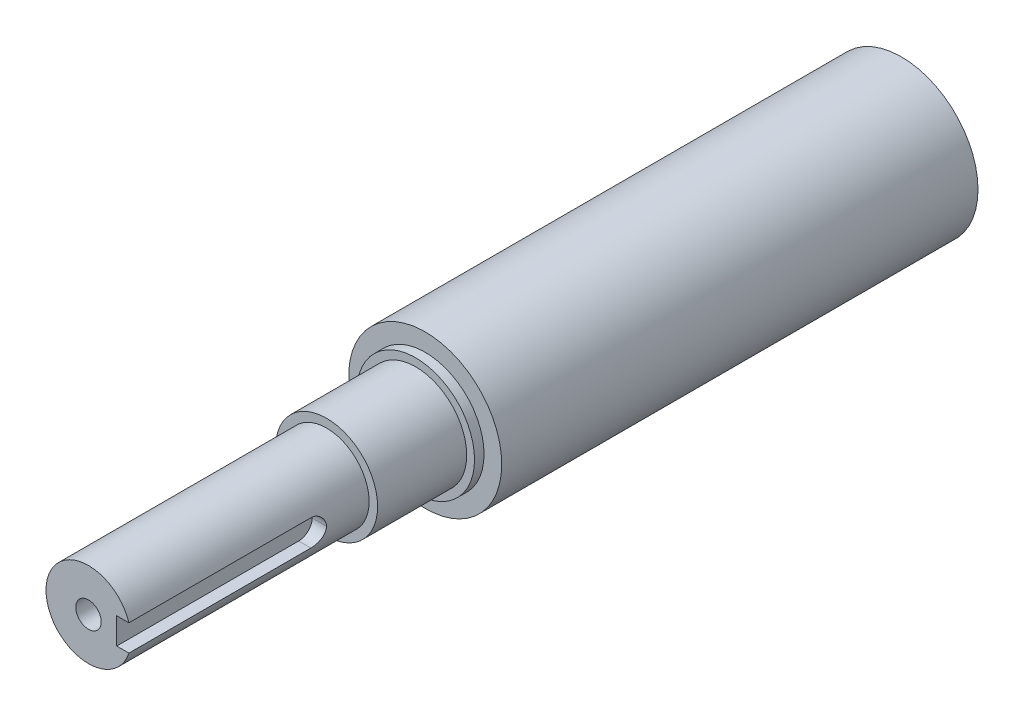
ISO-10303-21;
HEADER;
FILE_DESCRIPTION(('STEP AP214'),'2;1');
FILE_NAME('part.step','',(''),(''),'','','');
FILE_SCHEMA(('AUTOMOTIVE_DESIGN { 1 0 10303 214 1 1 1 1 }'));
ENDSEC;
DATA;
#1=APPLICATION_CONTEXT('core data for automotive mechanical design processes');
#2=APPLICATION_PROTOCOL_DEFINITION('international standard','automotive_design',2000,#1);
#3=PRODUCT_CONTEXT('',#1,'mechanical');
#4=PRODUCT('Part','Part','',(#3));
#5=PRODUCT_RELATED_PRODUCT_CATEGORY('part','',(#4));
#6=PRODUCT_DEFINITION_FORMATION('','',#4);
#7=PRODUCT_DEFINITION_CONTEXT('part definition',#1,'design');
#8=PRODUCT_DEFINITION('design','',#6,#7);
#9=PRODUCT_DEFINITION_SHAPE('','',#8);
#10=(LENGTH_UNIT() NAMED_UNIT(*) SI_UNIT(.MILLI.,.METRE.));
#11=(NAMED_UNIT(*) PLANE_ANGLE_UNIT() SI_UNIT($,.RADIAN.));
#12=(NAMED_UNIT(*) SI_UNIT($,.STERADIAN.) SOLID_ANGLE_UNIT());
#13=UNCERTAINTY_MEASURE_WITH_UNIT(LENGTH_MEASURE(1.E-05),#10,'distance_accuracy_value','');
#14=(GEOMETRIC_REPRESENTATION_CONTEXT(3) GLOBAL_UNCERTAINTY_ASSIGNED_CONTEXT((#13)) GLOBAL_UNIT_ASSIGNED_CONTEXT((#10,
#11,#12)) REPRESENTATION_CONTEXT('',''));
#15=CARTESIAN_POINT('',(0.,0.,0.));
#16=DIRECTION('',(0.,0.,1.));
#17=DIRECTION('',(1.,0.,0.));
#18=AXIS2_PLACEMENT_3D('',#15,#16,#17);
#19=CARTESIAN_POINT('',(0.,0.,61.087));
#20=DIRECTION('',(0.,0.,-1.));
#21=DIRECTION('',(-1.,0.,0.));
#22=AXIS2_PLACEMENT_3D('',#19,#20,#21);
#23=CYLINDRICAL_SURFACE('',#22,2.3749);
#24=CARTESIAN_POINT('',(0.,0.,-73.3552));
#25=DIRECTION('',(0.,0.,1.));
#26=DIRECTION('',(1.,0.,0.));
#27=AXIS2_PLACEMENT_3D('',#24,#25,#26);
#28=CIRCLE('',#27,2.3749);
#29=CARTESIAN_POINT('',(2.3749,0.,-73.3552));
#30=VERTEX_POINT('',#29);
#31=EDGE_CURVE('E44',#30,#30,#28,.T.);
#32=ORIENTED_EDGE('',*,*,#31,.T.);
#33=EDGE_LOOP('',(#32));
#34=FACE_BOUND('',#33,.T.);
#35=CARTESIAN_POINT('',(0.,0.,-92.4052));
#36=DIRECTION('',(0.,0.,1.));
#37=DIRECTION('',(1.,0.,0.));
#38=AXIS2_PLACEMENT_3D('',#35,#36,#37);
#39=CIRCLE('',#38,2.3749);
#40=CARTESIAN_POINT('',(2.3749,0.,-92.4052));
#41=VERTEX_POINT('',#40);
#42=EDGE_CURVE('E196',#41,#41,#39,.T.);
#43=ORIENTED_EDGE('',*,*,#42,.F.);
#44=EDGE_LOOP('',(#43));
#45=FACE_BOUND('',#44,.T.);
#46=ADVANCED_FACE('F36',(#34,#45),#23,.F.);
#47=CARTESIAN_POINT('',(0.,0.,0.));
#48=DIRECTION('',(0.,0.,1.));
#49=DIRECTION('',(1.,0.,0.));
#50=AXIS2_PLACEMENT_3D('',#47,#48,#49);
#51=PLANE('',#50);
#52=CARTESIAN_POINT('',(0.,0.,0.));
#53=DIRECTION('',(0.,0.,1.));
#54=DIRECTION('',(1.,0.,0.));
#55=AXIS2_PLACEMENT_3D('',#52,#53,#54);
#56=CIRCLE('',#55,9.525);
#57=CARTESIAN_POINT('',(9.525,0.,0.));
#58=VERTEX_POINT('',#57);
#59=EDGE_CURVE('E199',#58,#58,#56,.T.);
#60=ORIENTED_EDGE('',*,*,#59,.F.);
#61=EDGE_LOOP('',(#60));
#62=FACE_BOUND('',#61,.T.);
#63=CARTESIAN_POINT('',(0.,0.,0.));
#64=DIRECTION('',(0.,0.,1.));
#65=DIRECTION('',(1.,0.,0.));
#66=AXIS2_PLACEMENT_3D('',#63,#64,#65);
#67=CIRCLE('',#66,10.9855);
#68=CARTESIAN_POINT('',(10.9855,0.,0.));
#69=VERTEX_POINT('',#68);
#70=EDGE_CURVE('E206',#69,#69,#67,.T.);
#71=ORIENTED_EDGE('',*,*,#70,.T.);
#72=EDGE_LOOP('',(#71));
#73=FACE_BOUND('',#72,.T.);
#74=ADVANCED_FACE('F158',(#62,#73),#51,.T.);
#75=CARTESIAN_POINT('',(0.,0.,-90.7034));
#76=DIRECTION('',(0.,0.,1.));
#77=DIRECTION('',(1.,0.,0.));
#78=AXIS2_PLACEMENT_3D('',#75,#76,#77);
#79=CYLINDRICAL_SURFACE('',#78,14.2875);
#80=CARTESIAN_POINT('',(0.,0.,-90.7034));
#81=DIRECTION('',(0.,0.,1.));
#82=DIRECTION('',(1.,0.,0.));
#83=AXIS2_PLACEMENT_3D('',#80,#81,#82);
#84=CIRCLE('',#83,14.2875);
#85=CARTESIAN_POINT('',(14.2875,0.,-90.7034));
#86=VERTEX_POINT('',#85);
#87=EDGE_CURVE('E202',#86,#86,#84,.T.);
#88=CARTESIAN_POINT('',(0.,0.,-1.778));
#89=DIRECTION('',(0.,0.,1.));
#90=DIRECTION('',(1.,0.,0.));
#91=AXIS2_PLACEMENT_3D('',#88,#89,#90);
#92=CIRCLE('',#91,14.2875);
#93=CARTESIAN_POINT('',(14.2875,0.,-1.77799999999999));
#94=VERTEX_POINT('',#93);
#95=EDGE_CURVE('E209',#94,#94,#92,.T.);
#96=CARTESIAN_POINT('',(14.2875,0.,-90.7034));
#97=CARTESIAN_POINT('',(14.2875,0.,-89.77709375));
#98=CARTESIAN_POINT('',(14.2875,0.,-88.8507875));
#99=CARTESIAN_POINT('',(14.2875,0.,-86.998175));
#100=CARTESIAN_POINT('',(14.2875,0.,-86.07186875));
#101=CARTESIAN_POINT('',(14.2875,0.,-84.21925625));
#102=CARTESIAN_POINT('',(14.2875,0.,-83.29295));
#103=CARTESIAN_POINT('',(14.2875,0.,-81.4403375));
#104=CARTESIAN_POINT('',(14.2875,0.,-80.51403125));
#105=CARTESIAN_POINT('',(14.2875,0.,-78.66141875));
#106=CARTESIAN_POINT('',(14.2875,0.,-77.7351125));
#107=CARTESIAN_POINT('',(14.2875,0.,-75.8825));
#108=CARTESIAN_POINT('',(14.2875,0.,-74.95619375));
#109=CARTESIAN_POINT('',(14.2875,0.,-73.10358125));
#110=CARTESIAN_POINT('',(14.2875,0.,-72.177275));
#111=CARTESIAN_POINT('',(14.2875,0.,-70.3246625));
#112=CARTESIAN_POINT('',(14.2875,0.,-69.39835625));
#113=CARTESIAN_POINT('',(14.2875,0.,-67.54574375));
#114=CARTESIAN_POINT('',(14.2875,0.,-66.6194375));
#115=CARTESIAN_POINT('',(14.2875,0.,-64.766825));
#116=CARTESIAN_POINT('',(14.2875,0.,-63.84051875));
#117=CARTESIAN_POINT('',(14.2875,0.,-61.98790625));
#118=CARTESIAN_POINT('',(14.2875,0.,-61.0616));
#119=CARTESIAN_POINT('',(14.2875,0.,-59.2089875));
#120=CARTESIAN_POINT('',(14.2875,0.,-58.28268125));
#121=CARTESIAN_POINT('',(14.2875,0.,-56.43006875));
#122=CARTESIAN_POINT('',(14.2875,0.,-55.5037625));
#123=CARTESIAN_POINT('',(14.2875,0.,-53.65115));
#124=CARTESIAN_POINT('',(14.2875,0.,-52.72484375));
#125=CARTESIAN_POINT('',(14.2875,0.,-50.87223125));
#126=CARTESIAN_POINT('',(14.2875,0.,-49.945925));
#127=CARTESIAN_POINT('',(14.2875,0.,-48.0933125));
#128=CARTESIAN_POINT('',(14.2875,0.,-47.16700625));
#129=CARTESIAN_POINT('',(14.2875,0.,-45.31439375));
#130=CARTESIAN_POINT('',(14.2875,0.,-44.3880875));
#131=CARTESIAN_POINT('',(14.2875,0.,-42.535475));
#132=CARTESIAN_POINT('',(14.2875,0.,-41.60916875));
#133=CARTESIAN_POINT('',(14.2875,0.,-39.75655625));
#134=CARTESIAN_POINT('',(14.2875,0.,-38.83025));
#135=CARTESIAN_POINT('',(14.2875,0.,-36.9776375));
#136=CARTESIAN_POINT('',(14.2875,0.,-36.05133125));
#137=CARTESIAN_POINT('',(14.2875,0.,-34.19871875));
#138=CARTESIAN_POINT('',(14.2875,0.,-33.2724125));
#139=CARTESIAN_POINT('',(14.2875,0.,-31.4198));
#140=CARTESIAN_POINT('',(14.2875,0.,-30.49349375));
#141=CARTESIAN_POINT('',(14.2875,0.,-28.64088125));
#142=CARTESIAN_POINT('',(14.2875,0.,-27.714575));
#143=CARTESIAN_POINT('',(14.2875,0.,-25.8619625));
#144=CARTESIAN_POINT('',(14.2875,0.,-24.93565625));
#145=CARTESIAN_POINT('',(14.2875,0.,-23.08304375));
#146=CARTESIAN_POINT('',(14.2875,0.,-22.1567375));
#147=CARTESIAN_POINT('',(14.2875,0.,-20.304125));
#148=CARTESIAN_POINT('',(14.2875,0.,-19.37781875));
#149=CARTESIAN_POINT('',(14.2875,0.,-17.52520625));
#150=CARTESIAN_POINT('',(14.2875,0.,-16.5989));
#151=CARTESIAN_POINT('',(14.2875,0.,-14.7462875));
#152=CARTESIAN_POINT('',(14.2875,0.,-13.81998125));
#153=CARTESIAN_POINT('',(14.2875,0.,-11.96736875));
#154=CARTESIAN_POINT('',(14.2875,0.,-11.0410625));
#155=CARTESIAN_POINT('',(14.2875,0.,-9.18844999999999));
#156=CARTESIAN_POINT('',(14.2875,0.,-8.26214374999999));
#157=CARTESIAN_POINT('',(14.2875,0.,-6.40953124999998));
#158=CARTESIAN_POINT('',(14.2875,0.,-5.48322499999998));
#159=CARTESIAN_POINT('',(14.2875,0.,-3.63061249999999));
#160=CARTESIAN_POINT('',(14.2875,0.,-2.70430624999999));
#161=CARTESIAN_POINT('',(14.2875,0.,-1.77799999999999));
#162=B_SPLINE_CURVE_WITH_KNOTS('',3,(#96,#97,#98,#99,#100,#101,#102,#103,#104,#105,#106,#107,
#108,#109,#110,#111,#112,#113,#114,#115,#116,#117,#118,#119,#120,#121,#122,#123,#124,#125,#126,
#127,#128,#129,#130,#131,#132,#133,#134,#135,#136,#137,#138,#139,#140,#141,#142,#143,#144,#145,
#146,#147,#148,#149,#150,#151,#152,#153,#154,#155,#156,#157,#158,#159,#160,#161),.UNSPECIFIED.,
.F.,.F.,(4,2,2,2,2,2,2,2,2,2,2,2,2,2,2,2,2,2,2,2,2,2,2,2,2,2,2,2,2,2,2,2,4),(0.,2.77891875,
5.5578375,8.33675624999999,11.115675,13.89459375,16.6735125,19.45243125,22.23135,25.01026875,
27.7891875,30.56810625,33.347025,36.12594375,38.9048625,41.68378125,44.4627,47.24161875,
50.0205375,52.79945625,55.578375,58.35729375,61.1362125,63.91513125,66.69405,69.47296875,
72.2518875,75.03080625,77.809725,80.58864375,83.3675625,86.14648125,88.9254),.UNSPECIFIED.);
#163=EDGE_CURVE('BSEAM164',#86,#94,#162,.T.);
#164=ORIENTED_EDGE('',*,*,#87,.T.);
#165=ORIENTED_EDGE('',*,*,#95,.F.);
#166=ORIENTED_EDGE('',*,*,#163,.T.);
#167=ORIENTED_EDGE('',*,*,#163,.F.);
#168=EDGE_LOOP('',(#164,#166,#165,#167));
#169=FACE_BOUND('',#168,.T.);
#170=ADVANCED_FACE('F164',(#169),#79,.T.);
#171=CARTESIAN_POINT('',(0.,0.,16.637));
#172=DIRECTION('',(0.,0.,-1.));
#173=DIRECTION('',(-1.,0.,0.));
#174=AXIS2_PLACEMENT_3D('',#171,#172,#173);
#175=CYLINDRICAL_SURFACE('',#174,9.525);
#176=CARTESIAN_POINT('',(0.,0.,-92.4052));
#177=DIRECTION('',(0.,0.,1.));
#178=DIRECTION('',(1.,0.,0.));
#179=AXIS2_PLACEMENT_3D('',#176,#177,#178);
#180=CIRCLE('',#179,9.525);
#181=CARTESIAN_POINT('',(9.525,0.,-92.4052));
#182=VERTEX_POINT('',#181);
#183=EDGE_CURVE('E193',#182,#182,#180,.T.);
#184=ORIENTED_EDGE('',*,*,#183,.T.);
#185=EDGE_LOOP('',(#184));
#186=FACE_BOUND('',#185,.T.);
#187=CARTESIAN_POINT('',(0.,0.,-90.7034));
#188=DIRECTION('',(0.,0.,1.));
#189=DIRECTION('',(1.,0.,0.));
#190=AXIS2_PLACEMENT_3D('',#187,#188,#189);
#191=CIRCLE('',#190,9.525);
#192=CARTESIAN_POINT('',(9.525,0.,-90.7034));
#193=VERTEX_POINT('',#192);
#194=EDGE_CURVE('E107',#193,#193,#191,.T.);
#195=ORIENTED_EDGE('',*,*,#194,.F.);
#196=EDGE_LOOP('',(#195));
#197=FACE_BOUND('',#196,.T.);
#198=ADVANCED_FACE('F177',(#186,#197),#175,.T.);
#199=CARTESIAN_POINT('',(0.,0.,61.087));
#200=DIRECTION('',(0.,0.,-1.));
#201=DIRECTION('',(-1.,0.,0.));
#202=AXIS2_PLACEMENT_3D('',#199,#200,#201);
#203=CYLINDRICAL_SURFACE('',#202,7.9375);
#204=CARTESIAN_POINT('',(0.,0.,16.637));
#205=DIRECTION('',(0.,0.,1.));
#206=DIRECTION('',(1.,0.,0.));
#207=AXIS2_PLACEMENT_3D('',#204,#205,#206);
#208=CIRCLE('',#207,7.9375);
#209=CARTESIAN_POINT('',(7.9375,0.,16.637));
#210=VERTEX_POINT('',#209);
#211=EDGE_CURVE('E185',#210,#210,#208,.T.);
#212=ORIENTED_EDGE('',*,*,#211,.T.);
#213=EDGE_LOOP('',(#212));
#214=FACE_BOUND('',#213,.T.);
#215=DIRECTION('',(0.,0.,-1.));
#216=VECTOR('',#215,1.);
#217=CARTESIAN_POINT('',(7.54957052023491,2.4511,66.2940000000001));
#218=LINE('',#217,#216);
#219=CARTESIAN_POINT('',(7.54957052023491,2.4511,61.087));
#220=VERTEX_POINT('',#219);
#221=CARTESIAN_POINT('',(7.54957052023491,2.4511,27.1272));
#222=VERTEX_POINT('',#221);
#223=EDGE_CURVE('E86',#220,#222,#218,.T.);
#224=ORIENTED_EDGE('',*,*,#223,.T.);
#225=CARTESIAN_POINT('',(7.54957052023491,2.4511,27.1272));
#226=CARTESIAN_POINT('',(7.54956018894883,2.45110882095106,27.0575688864387));
#227=CARTESIAN_POINT('',(7.55049989588553,2.44823689325235,26.9879435505118));
#228=CARTESIAN_POINT('',(7.55420259851497,2.4368002166495,26.8492270109087));
#229=CARTESIAN_POINT('',(7.55696515774676,2.42823683049586,26.780135683376));
#230=CARTESIAN_POINT('',(7.56422694411467,2.40551683112306,26.6431626824346));
#231=CARTESIAN_POINT('',(7.56872142133974,2.39137551330411,26.5752782272026));
#232=CARTESIAN_POINT('',(7.57929753006119,2.35763984269347,26.4410222419456));
#233=CARTESIAN_POINT('',(7.58537920819746,2.3380453296585,26.3746507564416));
#234=CARTESIAN_POINT('',(7.60573263753937,2.27132694819722,26.1785447670609));
#235=CARTESIAN_POINT('',(7.62212311160074,2.21623794184425,26.0516381168384));
#236=CARTESIAN_POINT('',(7.65864004083031,2.08654051501969,25.8088494497866));
#237=CARTESIAN_POINT('',(7.67876855083991,2.01192134931412,25.6929735499389));
#238=CARTESIAN_POINT('',(7.72118065583425,1.8425819029942,25.4716130173533));
#239=CARTESIAN_POINT('',(7.74351114037441,1.74731989384157,25.3665509354735));
#240=CARTESIAN_POINT('',(7.78728362129282,1.54054249749643,25.1736083357556));
#241=CARTESIAN_POINT('',(7.80872545801244,1.42902420574283,25.0857308949351));
#242=CARTESIAN_POINT('',(7.84873899160792,1.19002857868304,24.92791173804));
#243=CARTESIAN_POINT('',(7.86724176559372,1.06226770089277,24.8583808023635));
#244=CARTESIAN_POINT('',(7.89859722174169,0.796211815736635,24.7419923612998));
#245=CARTESIAN_POINT('',(7.91145496788772,0.65792638086164,24.6951145306798));
#246=CARTESIAN_POINT('',(7.92712320367515,0.417659129507604,24.6361424375663));
#247=CARTESIAN_POINT('',(7.93179318475954,0.317282630293595,24.6178249535324));
#248=CARTESIAN_POINT('',(7.93732056174258,0.11498331411421,24.5933400205517));
#249=CARTESIAN_POINT('',(7.93817890001984,0.0130608856131782,24.5871695686209));
#250=CARTESIAN_POINT('',(7.93700214438676,-0.0889000000000003,24.5872));
#251=B_SPLINE_CURVE_WITH_KNOTS('',3,(#225,#226,#227,#228,#229,#230,#231,#232,#233,#234,#235,
#236,#237,#238,#239,#240,#241,#242,#243,#244,#245,#246,#247,#248,#249,#250),.UNSPECIFIED.,.F.,
.F.,(4,2,2,2,2,2,2,2,2,2,2,2,4),(0.,0.208817986354013,0.41758599178428,0.625785464643806,
0.833991056133667,1.24985887098746,1.66595597352105,2.09469212835583,2.52350498093356,
2.96123114322682,3.39856382825527,3.70422297968718,4.00980655670125),.UNSPECIFIED.);
#252=CARTESIAN_POINT('',(7.9375,0.,24.5887562267405));
#253=VERTEX_POINT('',#252);
#254=EDGE_CURVE('E51',#222,#253,#251,.T.);
#255=ORIENTED_EDGE('',*,*,#254,.T.);
#256=CARTESIAN_POINT('',(7.93700214438676,0.0889000000000003,24.5872));
#257=CARTESIAN_POINT('',(7.9377882087403,0.0194826714497865,24.5871912544108));
#258=CARTESIAN_POINT('',(7.93764664331152,-0.0499401074559921,24.5900455752525));
#259=CARTESIAN_POINT('',(7.93556590043781,-0.188279445941133,24.6014177536045));
#260=CARTESIAN_POINT('',(7.93362708668441,-0.257196105095185,24.6099344651736));
#261=CARTESIAN_POINT('',(7.92801702414085,-0.393857776142783,24.6325396301938));
#262=CARTESIAN_POINT('',(7.92435026511578,-0.461605355509519,24.6466136287289));
#263=CARTESIAN_POINT('',(7.9154071601739,-0.595612554132768,24.6801976340568));
#264=CARTESIAN_POINT('',(7.91013078348518,-0.661872144916618,24.699707744774));
#265=CARTESIAN_POINT('',(7.8921080076348,-0.857696899385309,24.7661603371037));
#266=CARTESIAN_POINT('',(7.87716097989313,-0.984465093178646,24.821051328591));
#267=CARTESIAN_POINT('',(7.84305150646317,-1.22699244439348,24.9502862741993));
#268=CARTESIAN_POINT('',(7.82388713529933,-1.34274653851416,25.024639116794));
#269=CARTESIAN_POINT('',(7.78281574750094,-1.56353273686541,25.1930706038276));
#270=CARTESIAN_POINT('',(7.76084803633083,-1.6681848211335,25.2876333029115));
#271=CARTESIAN_POINT('',(7.71701448251268,-1.86046887568714,25.4927774918092));
#272=CARTESIAN_POINT('',(7.69514867082799,-1.94809596487416,25.6033635597357));
#273=CARTESIAN_POINT('',(7.65341864958864,-2.10617488210723,25.8410558463036));
#274=CARTESIAN_POINT('',(7.63362531206206,-2.17609298581942,25.9685304229597));
#275=CARTESIAN_POINT('',(7.5992345444304,-2.29331475446118,26.2340751709894));
#276=CARTESIAN_POINT('',(7.58463217920775,-2.34063991352748,26.3721351260579));
#277=CARTESIAN_POINT('',(7.56577732070874,-2.40075414640126,26.6135157308526));
#278=CARTESIAN_POINT('',(7.55974860859858,-2.4195892658786,26.7152309506808));
#279=CARTESIAN_POINT('',(7.55162306559799,-2.44477822992477,26.9203419803928));
#280=CARTESIAN_POINT('',(7.54952608425322,-2.45113255209296,27.0237377258157));
#281=CARTESIAN_POINT('',(7.54957052023491,-2.4511,27.1272));
#282=B_SPLINE_CURVE_WITH_KNOTS('',3,(#256,#257,#258,#259,#260,#261,#262,#263,#264,#265,#266,
#267,#268,#269,#270,#271,#272,#273,#274,#275,#276,#277,#278,#279,#280,#281),.UNSPECIFIED.,.F.,
.F.,(4,2,2,2,2,2,2,2,2,2,2,2,4),(0.,0.208192061266788,0.416342001941373,0.623954058394777,
0.83157008412599,1.24633002012434,1.66127971376283,2.08758282813568,2.51400798464901,
2.95206546145268,3.38970535107059,3.69976678110282,4.00981634586548),.UNSPECIFIED.);
#283=CARTESIAN_POINT('',(7.54957052023491,-2.4511,27.1272));
#284=VERTEX_POINT('',#283);
#285=EDGE_CURVE('E120',#253,#284,#282,.T.);
#286=ORIENTED_EDGE('',*,*,#285,.T.);
#287=DIRECTION('',(0.,0.,-1.));
#288=VECTOR('',#287,1.);
#289=CARTESIAN_POINT('',(7.54957052023491,-2.4511,66.2940000000001));
#290=LINE('',#289,#288);
#291=CARTESIAN_POINT('',(7.54957052023491,-2.4511,61.087));
#292=VERTEX_POINT('',#291);
#293=EDGE_CURVE('E216',#292,#284,#290,.T.);
#294=ORIENTED_EDGE('',*,*,#293,.F.);
#295=CARTESIAN_POINT('',(0.,0.,61.087));
#296=DIRECTION('',(0.,0.,1.));
#297=DIRECTION('',(1.,0.,0.));
#298=AXIS2_PLACEMENT_3D('',#295,#296,#297);
#299=CIRCLE('',#298,7.9375);
#300=EDGE_CURVE('E184',#220,#292,#299,.T.);
#301=ORIENTED_EDGE('',*,*,#300,.F.);
#302=EDGE_LOOP('',(#224,#255,#286,#294,#301));
#303=FACE_BOUND('',#302,.T.);
#304=ADVANCED_FACE('F132',(#214,#303),#203,.T.);
#305=CARTESIAN_POINT('',(0.,0.,55.753));
#306=DIRECTION('',(0.,0.,1.));
#307=DIRECTION('',(1.,0.,0.));
#308=AXIS2_PLACEMENT_3D('',#305,#306,#307);
#309=CIRCLE('',#308,2.3749);
#310=CARTESIAN_POINT('',(2.3749,0.,55.753));
#311=VERTEX_POINT('',#310);
#312=EDGE_CURVE('E181',#311,#311,#309,.F.);
#313=ORIENTED_EDGE('',*,*,#312,.T.);
#314=EDGE_LOOP('',(#313));
#315=FACE_BOUND('',#314,.T.);
#316=CARTESIAN_POINT('',(0.,0.,61.087));
#317=DIRECTION('',(0.,0.,1.));
#318=DIRECTION('',(1.,0.,0.));
#319=AXIS2_PLACEMENT_3D('',#316,#317,#318);
#320=CIRCLE('',#319,2.3749);
#321=CARTESIAN_POINT('',(2.3749,0.,61.087));
#322=VERTEX_POINT('',#321);
#323=EDGE_CURVE('E112',#322,#322,#320,.T.);
#324=ORIENTED_EDGE('',*,*,#323,.T.);
#325=EDGE_LOOP('',(#324));
#326=FACE_BOUND('',#325,.T.);
#327=ADVANCED_FACE('F160',(#315,#326),#23,.F.);
#328=CARTESIAN_POINT('',(0.,0.,61.087));
#329=DIRECTION('',(0.,0.,1.));
#330=DIRECTION('',(1.,0.,0.));
#331=AXIS2_PLACEMENT_3D('',#328,#329,#330);
#332=PLANE('',#331);
#333=DIRECTION('',(1.,0.,0.));
#334=VECTOR('',#333,1.);
#335=CARTESIAN_POINT('',(0.,-2.4511,61.087));
#336=LINE('',#335,#334);
#337=CARTESIAN_POINT('',(5.2705,-2.4511,61.087));
#338=VERTEX_POINT('',#337);
#339=EDGE_CURVE('E91',#338,#292,#336,.T.);
#340=ORIENTED_EDGE('',*,*,#339,.F.);
#341=DIRECTION('',(0.,1.,0.));
#342=VECTOR('',#341,1.);
#343=CARTESIAN_POINT('',(5.2705,0.,61.087));
#344=LINE('',#343,#342);
#345=CARTESIAN_POINT('',(5.2705,2.4511,61.087));
#346=VERTEX_POINT('',#345);
#347=EDGE_CURVE('E97',#338,#346,#344,.T.);
#348=ORIENTED_EDGE('',*,*,#347,.T.);
#349=DIRECTION('',(1.,0.,0.));
#350=VECTOR('',#349,1.);
#351=CARTESIAN_POINT('',(0.,2.4511,61.087));
#352=LINE('',#351,#350);
#353=EDGE_CURVE('E82',#346,#220,#352,.T.);
#354=ORIENTED_EDGE('',*,*,#353,.T.);
#355=ORIENTED_EDGE('',*,*,#300,.T.);
#356=EDGE_LOOP('',(#340,#348,#354,#355));
#357=FACE_BOUND('',#356,.T.);
#358=ORIENTED_EDGE('',*,*,#323,.F.);
#359=EDGE_LOOP('',(#358));
#360=FACE_BOUND('',#359,.T.);
#361=ADVANCED_FACE('F104',(#357,#360),#332,.T.);
#362=ORIENTED_EDGE('',*,*,#59,.T.);
#363=EDGE_LOOP('',(#362));
#364=FACE_BOUND('',#363,.T.);
#365=CARTESIAN_POINT('',(0.,0.,16.637));
#366=DIRECTION('',(0.,0.,1.));
#367=DIRECTION('',(1.,0.,0.));
#368=AXIS2_PLACEMENT_3D('',#365,#366,#367);
#369=CIRCLE('',#368,9.525);
#370=CARTESIAN_POINT('',(9.525,0.,16.637));
#371=VERTEX_POINT('',#370);
#372=EDGE_CURVE('E190',#371,#371,#369,.T.);
#373=ORIENTED_EDGE('',*,*,#372,.F.);
#374=EDGE_LOOP('',(#373));
#375=FACE_BOUND('',#374,.T.);
#376=ADVANCED_FACE('F176',(#364,#375),#175,.T.);
#377=CARTESIAN_POINT('',(0.,0.,16.637));
#378=DIRECTION('',(0.,0.,1.));
#379=DIRECTION('',(1.,0.,0.));
#380=AXIS2_PLACEMENT_3D('',#377,#378,#379);
#381=PLANE('',#380);
#382=ORIENTED_EDGE('',*,*,#372,.T.);
#383=EDGE_LOOP('',(#382));
#384=FACE_BOUND('',#383,.T.);
#385=ORIENTED_EDGE('',*,*,#211,.F.);
#386=EDGE_LOOP('',(#385));
#387=FACE_BOUND('',#386,.T.);
#388=ADVANCED_FACE('F260',(#384,#387),#381,.T.);
#389=CARTESIAN_POINT('',(0.,0.,-92.4052));
#390=DIRECTION('',(0.,0.,1.));
#391=DIRECTION('',(1.,0.,0.));
#392=AXIS2_PLACEMENT_3D('',#389,#390,#391);
#393=PLANE('',#392);
#394=ORIENTED_EDGE('',*,*,#42,.T.);
#395=EDGE_LOOP('',(#394));
#396=FACE_BOUND('',#395,.T.);
#397=ORIENTED_EDGE('',*,*,#183,.F.);
#398=EDGE_LOOP('',(#397));
#399=FACE_BOUND('',#398,.T.);
#400=ADVANCED_FACE('F255',(#396,#399),#393,.F.);
#401=CARTESIAN_POINT('',(0.,0.,-90.7034));
#402=DIRECTION('',(0.,0.,1.));
#403=DIRECTION('',(1.,0.,0.));
#404=AXIS2_PLACEMENT_3D('',#401,#402,#403);
#405=PLANE('',#404);
#406=ORIENTED_EDGE('',*,*,#194,.T.);
#407=EDGE_LOOP('',(#406));
#408=FACE_BOUND('',#407,.T.);
#409=ORIENTED_EDGE('',*,*,#87,.F.);
#410=EDGE_LOOP('',(#409));
#411=FACE_BOUND('',#410,.T.);
#412=ADVANCED_FACE('F249',(#408,#411),#405,.F.);
#413=CARTESIAN_POINT('',(0.,0.,-1.778));
#414=DIRECTION('',(0.,0.,1.));
#415=DIRECTION('',(1.,0.,0.));
#416=AXIS2_PLACEMENT_3D('',#413,#414,#415);
#417=CYLINDRICAL_SURFACE('',#416,10.9855);
#418=CARTESIAN_POINT('',(0.,0.,-1.778));
#419=DIRECTION('',(0.,0.,1.));
#420=DIRECTION('',(1.,0.,0.));
#421=AXIS2_PLACEMENT_3D('',#418,#419,#420);
#422=CIRCLE('',#421,10.9855);
#423=CARTESIAN_POINT('',(10.9855,0.,-1.778));
#424=VERTEX_POINT('',#423);
#425=EDGE_CURVE('E205',#424,#424,#422,.T.);
#426=ORIENTED_EDGE('',*,*,#425,.T.);
#427=EDGE_LOOP('',(#426));
#428=FACE_BOUND('',#427,.T.);
#429=ORIENTED_EDGE('',*,*,#70,.F.);
#430=EDGE_LOOP('',(#429));
#431=FACE_BOUND('',#430,.T.);
#432=ADVANCED_FACE('F245',(#428,#431),#417,.T.);
#433=CARTESIAN_POINT('',(0.,0.,-1.778));
#434=DIRECTION('',(0.,0.,1.));
#435=DIRECTION('',(1.,0.,0.));
#436=AXIS2_PLACEMENT_3D('',#433,#434,#435);
#437=PLANE('',#436);
#438=ORIENTED_EDGE('',*,*,#95,.T.);
#439=EDGE_LOOP('',(#438));
#440=FACE_BOUND('',#439,.T.);
#441=ORIENTED_EDGE('',*,*,#425,.F.);
#442=EDGE_LOOP('',(#441));
#443=FACE_BOUND('',#442,.T.);
#444=ADVANCED_FACE('F240',(#440,#443),#437,.T.);
#445=CARTESIAN_POINT('',(5.2705,0.,66.2940000000001));
#446=DIRECTION('',(1.,0.,0.));
#447=DIRECTION('',(0.,0.,-1.));
#448=AXIS2_PLACEMENT_3D('',#445,#446,#447);
#449=PLANE('',#448);
#450=DIRECTION('',(0.,0.,-1.));
#451=VECTOR('',#450,1.);
#452=CARTESIAN_POINT('',(5.2705,-2.4511,66.2940000000001));
#453=LINE('',#452,#451);
#454=CARTESIAN_POINT('',(5.2705,-2.4511,27.1272));
#455=VERTEX_POINT('',#454);
#456=EDGE_CURVE('E92',#338,#455,#453,.T.);
#457=ORIENTED_EDGE('',*,*,#456,.T.);
#458=CARTESIAN_POINT('',(5.2705,0.0889000000000003,27.1272));
#459=DIRECTION('',(1.,0.,0.));
#460=DIRECTION('',(0.,0.,-1.));
#461=AXIS2_PLACEMENT_3D('',#458,#459,#460);
#462=CIRCLE('',#461,2.54);
#463=CARTESIAN_POINT('',(5.2705,0.,24.5887562267405));
#464=VERTEX_POINT('',#463);
#465=EDGE_CURVE('E117',#455,#464,#462,.T.);
#466=ORIENTED_EDGE('',*,*,#465,.T.);
#467=CARTESIAN_POINT('',(5.2705,-0.0889000000000003,27.1272));
#468=DIRECTION('',(1.,0.,0.));
#469=DIRECTION('',(0.,0.,-1.));
#470=AXIS2_PLACEMENT_3D('',#467,#468,#469);
#471=CIRCLE('',#470,2.54);
#472=CARTESIAN_POINT('',(5.2705,2.4511,27.1272));
#473=VERTEX_POINT('',#472);
#474=EDGE_CURVE('E100',#464,#473,#471,.T.);
#475=ORIENTED_EDGE('',*,*,#474,.T.);
#476=DIRECTION('',(0.,0.,-1.));
#477=VECTOR('',#476,1.);
#478=CARTESIAN_POINT('',(5.2705,2.4511,66.2940000000001));
#479=LINE('',#478,#477);
#480=EDGE_CURVE('E85',#346,#473,#479,.T.);
#481=ORIENTED_EDGE('',*,*,#480,.F.);
#482=ORIENTED_EDGE('',*,*,#347,.F.);
#483=EDGE_LOOP('',(#457,#466,#475,#481,#482));
#484=FACE_BOUND('',#483,.T.);
#485=ADVANCED_FACE('F96',(#484),#449,.T.);
#486=CARTESIAN_POINT('',(0.,-2.4511,66.2940000000001));
#487=DIRECTION('',(0.,-1.,0.));
#488=DIRECTION('',(0.,0.,-1.));
#489=AXIS2_PLACEMENT_3D('',#486,#487,#488);
#490=PLANE('',#489);
#491=ORIENTED_EDGE('',*,*,#293,.T.);
#492=DIRECTION('',(-1.,0.,0.));
#493=VECTOR('',#492,1.);
#494=CARTESIAN_POINT('',(0.,-2.4511,27.1272));
#495=LINE('',#494,#493);
#496=EDGE_CURVE('E106',#284,#455,#495,.T.);
#497=ORIENTED_EDGE('',*,*,#496,.T.);
#498=ORIENTED_EDGE('',*,*,#456,.F.);
#499=ORIENTED_EDGE('',*,*,#339,.T.);
#500=EDGE_LOOP('',(#491,#497,#498,#499));
#501=FACE_BOUND('',#500,.T.);
#502=ADVANCED_FACE('F232',(#501),#490,.F.);
#503=CARTESIAN_POINT('',(0.,2.4511,66.2940000000001));
#504=DIRECTION('',(0.,-1.,0.));
#505=DIRECTION('',(0.,0.,-1.));
#506=AXIS2_PLACEMENT_3D('',#503,#504,#505);
#507=PLANE('',#506);
#508=ORIENTED_EDGE('',*,*,#480,.T.);
#509=DIRECTION('',(-1.,0.,0.));
#510=VECTOR('',#509,1.);
#511=CARTESIAN_POINT('',(7.54957052023491,2.4511,27.1272));
#512=LINE('',#511,#510);
#513=EDGE_CURVE('E59',#473,#222,#512,.F.);
#514=ORIENTED_EDGE('',*,*,#513,.T.);
#515=ORIENTED_EDGE('',*,*,#223,.F.);
#516=ORIENTED_EDGE('',*,*,#353,.F.);
#517=EDGE_LOOP('',(#508,#514,#515,#516));
#518=FACE_BOUND('',#517,.T.);
#519=ADVANCED_FACE('F84',(#518),#507,.T.);
#520=CARTESIAN_POINT('',(0.,-0.0889000000000003,27.1272));
#521=DIRECTION('',(1.,0.,0.));
#522=DIRECTION('',(0.,0.,-1.));
#523=AXIS2_PLACEMENT_3D('',#520,#521,#522);
#524=CYLINDRICAL_SURFACE('',#523,2.54);
#525=DIRECTION('',(-1.,0.,0.));
#526=VECTOR('',#525,1.);
#527=CARTESIAN_POINT('',(6.60375107219338,0.,24.5887562267405));
#528=LINE('',#527,#526);
#529=EDGE_CURVE('E101',#253,#464,#528,.T.);
#530=ORIENTED_EDGE('',*,*,#529,.F.);
#531=ORIENTED_EDGE('',*,*,#254,.F.);
#532=ORIENTED_EDGE('',*,*,#513,.F.);
#533=ORIENTED_EDGE('',*,*,#474,.F.);
#534=EDGE_LOOP('',(#530,#531,#532,#533));
#535=FACE_BOUND('',#534,.T.);
#536=ADVANCED_FACE('F139',(#535),#524,.F.);
#537=CARTESIAN_POINT('',(0.,0.0889000000000003,27.1272));
#538=DIRECTION('',(-1.,0.,0.));
#539=DIRECTION('',(0.,0.,1.));
#540=AXIS2_PLACEMENT_3D('',#537,#538,#539);
#541=CYLINDRICAL_SURFACE('',#540,2.54);
#542=ORIENTED_EDGE('',*,*,#285,.F.);
#543=ORIENTED_EDGE('',*,*,#529,.T.);
#544=ORIENTED_EDGE('',*,*,#465,.F.);
#545=ORIENTED_EDGE('',*,*,#496,.F.);
#546=EDGE_LOOP('',(#542,#543,#544,#545));
#547=FACE_BOUND('',#546,.T.);
#548=ADVANCED_FACE('F135',(#547),#541,.F.);
#549=CARTESIAN_POINT('',(0.,0.,53.467));
#550=DIRECTION('',(0.,0.,1.));
#551=DIRECTION('',(1.,0.,0.));
#552=AXIS2_PLACEMENT_3D('',#549,#550,#551);
#553=PLANE('',#552);
#554=CARTESIAN_POINT('',(0.,0.,53.467));
#555=DIRECTION('',(0.,0.,1.));
#556=DIRECTION('',(1.,0.,0.));
#557=AXIS2_PLACEMENT_3D('',#554,#555,#556);
#558=CIRCLE('',#557,0.0889000000000007);
#559=CARTESIAN_POINT('',(0.0889000000000007,0.,53.467));
#560=VERTEX_POINT('',#559);
#561=EDGE_CURVE('E222',#560,#560,#558,.T.);
#562=ORIENTED_EDGE('',*,*,#561,.T.);
#563=EDGE_LOOP('',(#562));
#564=FACE_BOUND('',#563,.T.);
#565=ADVANCED_FACE('F138',(#564),#553,.T.);
#566=CARTESIAN_POINT('',(0.,0.,-71.0692));
#567=DIRECTION('',(0.,0.,1.));
#568=DIRECTION('',(1.,0.,0.));
#569=AXIS2_PLACEMENT_3D('',#566,#567,#568);
#570=PLANE('',#569);
#571=CARTESIAN_POINT('',(0.,0.,-71.0692));
#572=DIRECTION('',(0.,0.,1.));
#573=DIRECTION('',(1.,0.,0.));
#574=AXIS2_PLACEMENT_3D('',#571,#572,#573);
#575=CIRCLE('',#574,0.0889000000000007);
#576=CARTESIAN_POINT('',(0.0889000000000007,0.,-71.0692));
#577=VERTEX_POINT('',#576);
#578=EDGE_CURVE('E11',#577,#577,#575,.F.);
#579=ORIENTED_EDGE('',*,*,#578,.T.);
#580=EDGE_LOOP('',(#579));
#581=FACE_BOUND('',#580,.T.);
#582=ADVANCED_FACE('F146',(#581),#570,.F.);
#583=CARTESIAN_POINT('',(0.,0.,55.753));
#584=DIRECTION('',(0.,0.,1.));
#585=DIRECTION('',(1.,0.,0.));
#586=AXIS2_PLACEMENT_3D('',#583,#584,#585);
#587=DEGENERATE_TOROIDAL_SURFACE('',#586,0.0889000000000007,2.286,.T.);
#588=ORIENTED_EDGE('',*,*,#312,.F.);
#589=EDGE_LOOP('',(#588));
#590=FACE_BOUND('',#589,.T.);
#591=ORIENTED_EDGE('',*,*,#561,.F.);
#592=EDGE_LOOP('',(#591));
#593=FACE_BOUND('',#592,.T.);
#594=ADVANCED_FACE('F144',(#590,#593),#587,.F.);
#595=CARTESIAN_POINT('',(0.,0.,-73.3552));
#596=DIRECTION('',(0.,0.,1.));
#597=DIRECTION('',(1.,0.,0.));
#598=AXIS2_PLACEMENT_3D('',#595,#596,#597);
#599=DEGENERATE_TOROIDAL_SURFACE('',#598,0.0889000000000007,2.286,.T.);
#600=ORIENTED_EDGE('',*,*,#578,.F.);
#601=EDGE_LOOP('',(#600));
#602=FACE_BOUND('',#601,.T.);
#603=ORIENTED_EDGE('',*,*,#31,.F.);
#604=EDGE_LOOP('',(#603));
#605=FACE_BOUND('',#604,.T.);
#606=ADVANCED_FACE('F38',(#602,#605),#599,.F.);
#607=CLOSED_SHELL('',(#46,#74,#170,#198,#304,#327,#361,#376,#388,#400,#412,#432,#444,#485,#502,
#519,#536,#548,#565,#582,#594,#606));
#608=MANIFOLD_SOLID_BREP('B2',#607);
#609=ADVANCED_BREP_SHAPE_REPRESENTATION('',(#18,#608),#14);
#610=SHAPE_DEFINITION_REPRESENTATION(#9,#609);
ENDSEC;
END-ISO-10303-21;
